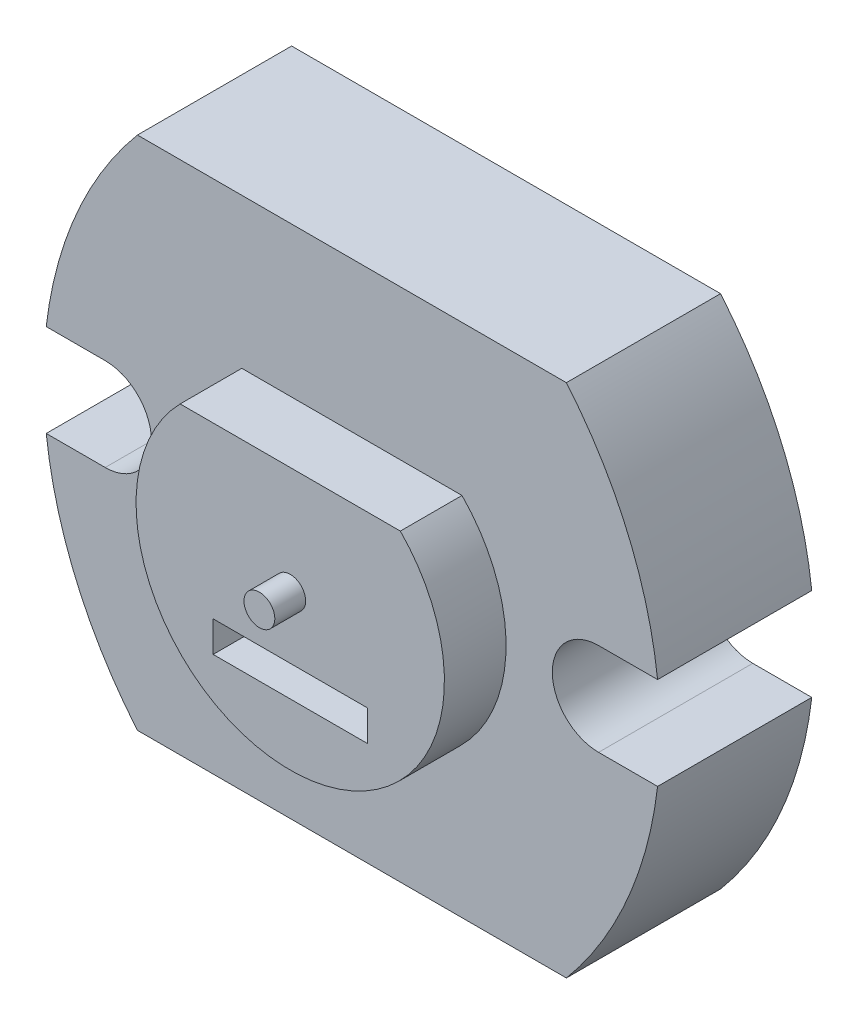
ISO-10303-21;
HEADER;
FILE_DESCRIPTION(('STEP AP214'),'2;1');
FILE_NAME('part.step','',(''),(''),'','','');
FILE_SCHEMA(('AUTOMOTIVE_DESIGN { 1 0 10303 214 1 1 1 1 }'));
ENDSEC;
DATA;
#1=APPLICATION_CONTEXT('core data for automotive mechanical design processes');
#2=APPLICATION_PROTOCOL_DEFINITION('international standard','automotive_design',2000,#1);
#3=PRODUCT_CONTEXT('',#1,'mechanical');
#4=PRODUCT('Part','Part','',(#3));
#5=PRODUCT_RELATED_PRODUCT_CATEGORY('part','',(#4));
#6=PRODUCT_DEFINITION_FORMATION('','',#4);
#7=PRODUCT_DEFINITION_CONTEXT('part definition',#1,'design');
#8=PRODUCT_DEFINITION('design','',#6,#7);
#9=PRODUCT_DEFINITION_SHAPE('','',#8);
#10=(LENGTH_UNIT() NAMED_UNIT(*) SI_UNIT(.MILLI.,.METRE.));
#11=(NAMED_UNIT(*) PLANE_ANGLE_UNIT() SI_UNIT($,.RADIAN.));
#12=(NAMED_UNIT(*) SI_UNIT($,.STERADIAN.) SOLID_ANGLE_UNIT());
#13=UNCERTAINTY_MEASURE_WITH_UNIT(LENGTH_MEASURE(1.E-05),#10,'distance_accuracy_value','');
#14=(GEOMETRIC_REPRESENTATION_CONTEXT(3) GLOBAL_UNCERTAINTY_ASSIGNED_CONTEXT((#13)) GLOBAL_UNIT_ASSIGNED_CONTEXT((#10,
#11,#12)) REPRESENTATION_CONTEXT('',''));
#15=CARTESIAN_POINT('',(0.,0.,0.));
#16=DIRECTION('',(0.,0.,1.));
#17=DIRECTION('',(1.,0.,0.));
#18=AXIS2_PLACEMENT_3D('',#15,#16,#17);
#19=CARTESIAN_POINT('',(0.,0.,5.));
#20=DIRECTION('',(0.,0.,1.));
#21=DIRECTION('',(1.,0.,0.));
#22=AXIS2_PLACEMENT_3D('',#19,#20,#21);
#23=PLANE('',#22);
#24=DIRECTION('',(1.,0.,0.));
#25=VECTOR('',#24,1.);
#26=CARTESIAN_POINT('',(-8.,-1.5,5.));
#27=LINE('',#26,#25);
#28=CARTESIAN_POINT('',(-9.91317157014496,-1.5,5.));
#29=VERTEX_POINT('',#28);
#30=CARTESIAN_POINT('',(-8.,-1.5,5.));
#31=VERTEX_POINT('',#30);
#32=EDGE_CURVE('E220',#29,#31,#27,.T.);
#33=ORIENTED_EDGE('',*,*,#32,.F.);
#34=CARTESIAN_POINT('',(3.,0.,5.));
#35=DIRECTION('',(0.,0.,1.));
#36=DIRECTION('',(1.,0.,0.));
#37=AXIS2_PLACEMENT_3D('',#34,#35,#36);
#38=CIRCLE('',#37,13.);
#39=CARTESIAN_POINT('',(-6.95542063400638,-8.36,5.));
#40=VERTEX_POINT('',#39);
#41=EDGE_CURVE('E262',#40,#29,#38,.F.);
#42=ORIENTED_EDGE('',*,*,#41,.F.);
#43=DIRECTION('',(1.,0.,0.));
#44=VECTOR('',#43,1.);
#45=CARTESIAN_POINT('',(0.,-8.36,5.));
#46=LINE('',#45,#44);
#47=CARTESIAN_POINT('',(6.95542063400638,-8.36,5.));
#48=VERTEX_POINT('',#47);
#49=EDGE_CURVE('E265',#40,#48,#46,.T.);
#50=ORIENTED_EDGE('',*,*,#49,.T.);
#51=CARTESIAN_POINT('',(-3.,0.,5.));
#52=DIRECTION('',(0.,0.,1.));
#53=DIRECTION('',(1.,0.,0.));
#54=AXIS2_PLACEMENT_3D('',#51,#52,#53);
#55=CIRCLE('',#54,13.);
#56=CARTESIAN_POINT('',(9.91317157014496,-1.5,5.));
#57=VERTEX_POINT('',#56);
#58=EDGE_CURVE('E269',#48,#57,#55,.T.);
#59=ORIENTED_EDGE('',*,*,#58,.T.);
#60=DIRECTION('',(1.,0.,0.));
#61=VECTOR('',#60,1.);
#62=CARTESIAN_POINT('',(9.91317157014496,-1.5,5.));
#63=LINE('',#62,#61);
#64=CARTESIAN_POINT('',(8.,-1.5,5.));
#65=VERTEX_POINT('',#64);
#66=EDGE_CURVE('E248',#65,#57,#63,.T.);
#67=ORIENTED_EDGE('',*,*,#66,.F.);
#68=CARTESIAN_POINT('',(8.,0.,5.));
#69=DIRECTION('',(0.,0.,1.));
#70=DIRECTION('',(-1.,0.,0.));
#71=AXIS2_PLACEMENT_3D('',#68,#69,#70);
#72=CIRCLE('',#71,1.5);
#73=CARTESIAN_POINT('',(8.,1.5,5.));
#74=VERTEX_POINT('',#73);
#75=EDGE_CURVE('E237',#74,#65,#72,.T.);
#76=ORIENTED_EDGE('',*,*,#75,.F.);
#77=DIRECTION('',(-1.,0.,0.));
#78=VECTOR('',#77,1.);
#79=CARTESIAN_POINT('',(8.,1.5,5.));
#80=LINE('',#79,#78);
#81=CARTESIAN_POINT('',(9.91317157014496,1.5,5.));
#82=VERTEX_POINT('',#81);
#83=EDGE_CURVE('E242',#82,#74,#80,.T.);
#84=ORIENTED_EDGE('',*,*,#83,.F.);
#85=CARTESIAN_POINT('',(6.95542063400638,8.36,5.));
#86=VERTEX_POINT('',#85);
#87=EDGE_CURVE('E268',#82,#86,#55,.T.);
#88=ORIENTED_EDGE('',*,*,#87,.T.);
#89=DIRECTION('',(1.,0.,0.));
#90=VECTOR('',#89,1.);
#91=CARTESIAN_POINT('',(0.,8.36,5.));
#92=LINE('',#91,#90);
#93=CARTESIAN_POINT('',(-6.95542063400638,8.36,5.));
#94=VERTEX_POINT('',#93);
#95=EDGE_CURVE('E272',#94,#86,#92,.T.);
#96=ORIENTED_EDGE('',*,*,#95,.F.);
#97=CARTESIAN_POINT('',(-9.91317157014496,1.5,5.));
#98=VERTEX_POINT('',#97);
#99=EDGE_CURVE('E266',#98,#94,#38,.F.);
#100=ORIENTED_EDGE('',*,*,#99,.F.);
#101=DIRECTION('',(-1.,0.,0.));
#102=VECTOR('',#101,1.);
#103=CARTESIAN_POINT('',(-9.91317157014496,1.5,5.));
#104=LINE('',#103,#102);
#105=CARTESIAN_POINT('',(-8.,1.5,5.));
#106=VERTEX_POINT('',#105);
#107=EDGE_CURVE('E226',#106,#98,#104,.T.);
#108=ORIENTED_EDGE('',*,*,#107,.F.);
#109=CARTESIAN_POINT('',(-8.,0.,5.));
#110=DIRECTION('',(0.,0.,1.));
#111=DIRECTION('',(1.,0.,0.));
#112=AXIS2_PLACEMENT_3D('',#109,#110,#111);
#113=CIRCLE('',#112,1.5);
#114=EDGE_CURVE('E215',#31,#106,#113,.T.);
#115=ORIENTED_EDGE('',*,*,#114,.F.);
#116=EDGE_LOOP('',(#33,#42,#50,#59,#67,#76,#84,#88,#96,#100,#108,#115));
#117=FACE_BOUND('',#116,.T.);
#118=DIRECTION('',(-1.,0.,0.));
#119=VECTOR('',#118,1.);
#120=CARTESIAN_POINT('',(-3.57071421427143,3.5,5.));
#121=LINE('',#120,#119);
#122=CARTESIAN_POINT('',(3.57071421427143,3.5,5.));
#123=VERTEX_POINT('',#122);
#124=CARTESIAN_POINT('',(-3.57071421427143,3.5,5.));
#125=VERTEX_POINT('',#124);
#126=EDGE_CURVE('E204',#123,#125,#121,.T.);
#127=ORIENTED_EDGE('',*,*,#126,.F.);
#128=CARTESIAN_POINT('',(0.,0.,5.));
#129=DIRECTION('',(0.,0.,1.));
#130=DIRECTION('',(1.,0.,0.));
#131=AXIS2_PLACEMENT_3D('',#128,#129,#130);
#132=CIRCLE('',#131,5.);
#133=EDGE_CURVE('E58',#125,#123,#132,.T.);
#134=ORIENTED_EDGE('',*,*,#133,.F.);
#135=EDGE_LOOP('',(#127,#134));
#136=FACE_BOUND('',#135,.T.);
#137=ADVANCED_FACE('F34',(#117,#136),#23,.T.);
#138=CARTESIAN_POINT('',(3.,0.,5.));
#139=DIRECTION('',(0.,0.,-1.));
#140=DIRECTION('',(-1.,0.,0.));
#141=AXIS2_PLACEMENT_3D('',#138,#139,#140);
#142=CYLINDRICAL_SURFACE('',#141,13.);
#143=DIRECTION('',(0.,0.,-1.));
#144=VECTOR('',#143,1.);
#145=CARTESIAN_POINT('',(-9.91317157014496,-1.5,5.));
#146=LINE('',#145,#144);
#147=CARTESIAN_POINT('',(-9.91317157014496,-1.5,0.));
#148=VERTEX_POINT('',#147);
#149=EDGE_CURVE('E235',#148,#29,#146,.F.);
#150=ORIENTED_EDGE('',*,*,#149,.F.);
#151=CARTESIAN_POINT('',(3.,0.,0.));
#152=DIRECTION('',(0.,0.,1.));
#153=DIRECTION('',(1.,0.,0.));
#154=AXIS2_PLACEMENT_3D('',#151,#152,#153);
#155=CIRCLE('',#154,13.);
#156=CARTESIAN_POINT('',(-6.95542063400638,-8.36,0.));
#157=VERTEX_POINT('',#156);
#158=EDGE_CURVE('E276',#157,#148,#155,.F.);
#159=ORIENTED_EDGE('',*,*,#158,.F.);
#160=DIRECTION('',(0.,0.,-1.));
#161=VECTOR('',#160,1.);
#162=CARTESIAN_POINT('',(-6.95542063400638,-8.36,5.));
#163=LINE('',#162,#161);
#164=EDGE_CURVE('E296',#40,#157,#163,.T.);
#165=ORIENTED_EDGE('',*,*,#164,.F.);
#166=ORIENTED_EDGE('',*,*,#41,.T.);
#167=EDGE_LOOP('',(#150,#159,#165,#166));
#168=FACE_BOUND('',#167,.T.);
#169=ADVANCED_FACE('F335',(#168),#142,.T.);
#170=CARTESIAN_POINT('',(-3.,0.,5.));
#171=DIRECTION('',(0.,0.,-1.));
#172=DIRECTION('',(-1.,0.,0.));
#173=AXIS2_PLACEMENT_3D('',#170,#171,#172);
#174=CYLINDRICAL_SURFACE('',#173,13.);
#175=ORIENTED_EDGE('',*,*,#87,.F.);
#176=DIRECTION('',(0.,0.,-1.));
#177=VECTOR('',#176,1.);
#178=CARTESIAN_POINT('',(9.91317157014496,1.5,5.));
#179=LINE('',#178,#177);
#180=CARTESIAN_POINT('',(9.91317157014496,1.5,0.));
#181=VERTEX_POINT('',#180);
#182=EDGE_CURVE('E258',#82,#181,#179,.T.);
#183=ORIENTED_EDGE('',*,*,#182,.T.);
#184=CARTESIAN_POINT('',(-3.,0.,0.));
#185=DIRECTION('',(0.,0.,1.));
#186=DIRECTION('',(1.,0.,0.));
#187=AXIS2_PLACEMENT_3D('',#184,#185,#186);
#188=CIRCLE('',#187,13.);
#189=CARTESIAN_POINT('',(6.95542063400638,8.36,0.));
#190=VERTEX_POINT('',#189);
#191=EDGE_CURVE('E281',#181,#190,#188,.T.);
#192=ORIENTED_EDGE('',*,*,#191,.T.);
#193=DIRECTION('',(0.,0.,-1.));
#194=VECTOR('',#193,1.);
#195=CARTESIAN_POINT('',(6.95542063400638,8.36,5.));
#196=LINE('',#195,#194);
#197=EDGE_CURVE('E290',#86,#190,#196,.T.);
#198=ORIENTED_EDGE('',*,*,#197,.F.);
#199=EDGE_LOOP('',(#175,#183,#192,#198));
#200=FACE_BOUND('',#199,.T.);
#201=ADVANCED_FACE('F308',(#200),#174,.T.);
#202=DIRECTION('',(0.,0.,-1.));
#203=VECTOR('',#202,1.);
#204=CARTESIAN_POINT('',(-9.91317157014496,1.5,5.));
#205=LINE('',#204,#203);
#206=CARTESIAN_POINT('',(-9.91317157014496,1.5,0.));
#207=VERTEX_POINT('',#206);
#208=EDGE_CURVE('E232',#98,#207,#205,.T.);
#209=ORIENTED_EDGE('',*,*,#208,.F.);
#210=ORIENTED_EDGE('',*,*,#99,.T.);
#211=DIRECTION('',(0.,0.,-1.));
#212=VECTOR('',#211,1.);
#213=CARTESIAN_POINT('',(-6.95542063400638,8.36,5.));
#214=LINE('',#213,#212);
#215=CARTESIAN_POINT('',(-6.95542063400638,8.36,0.));
#216=VERTEX_POINT('',#215);
#217=EDGE_CURVE('E275',#94,#216,#214,.T.);
#218=ORIENTED_EDGE('',*,*,#217,.T.);
#219=EDGE_CURVE('E261',#207,#216,#155,.F.);
#220=ORIENTED_EDGE('',*,*,#219,.F.);
#221=EDGE_LOOP('',(#209,#210,#218,#220));
#222=FACE_BOUND('',#221,.T.);
#223=ADVANCED_FACE('F36',(#222),#142,.T.);
#224=CARTESIAN_POINT('',(0.,-8.36,5.));
#225=DIRECTION('',(0.,1.,0.));
#226=DIRECTION('',(-1.,0.,0.));
#227=AXIS2_PLACEMENT_3D('',#224,#225,#226);
#228=PLANE('',#227);
#229=DIRECTION('',(1.,0.,0.));
#230=VECTOR('',#229,1.);
#231=CARTESIAN_POINT('',(0.,-8.36,0.));
#232=LINE('',#231,#230);
#233=CARTESIAN_POINT('',(6.95542063400638,-8.36,0.));
#234=VERTEX_POINT('',#233);
#235=EDGE_CURVE('E279',#157,#234,#232,.T.);
#236=ORIENTED_EDGE('',*,*,#235,.T.);
#237=DIRECTION('',(0.,0.,-1.));
#238=VECTOR('',#237,1.);
#239=CARTESIAN_POINT('',(6.95542063400638,-8.36,5.));
#240=LINE('',#239,#238);
#241=EDGE_CURVE('E293',#48,#234,#240,.T.);
#242=ORIENTED_EDGE('',*,*,#241,.F.);
#243=ORIENTED_EDGE('',*,*,#49,.F.);
#244=ORIENTED_EDGE('',*,*,#164,.T.);
#245=EDGE_LOOP('',(#236,#242,#243,#244));
#246=FACE_BOUND('',#245,.T.);
#247=ADVANCED_FACE('F330',(#246),#228,.F.);
#248=CARTESIAN_POINT('',(9.91317157014496,-1.5,0.));
#249=VERTEX_POINT('',#248);
#250=EDGE_CURVE('E282',#234,#249,#188,.T.);
#251=ORIENTED_EDGE('',*,*,#250,.T.);
#252=DIRECTION('',(0.,0.,-1.));
#253=VECTOR('',#252,1.);
#254=CARTESIAN_POINT('',(9.91317157014496,-1.5,5.));
#255=LINE('',#254,#253);
#256=EDGE_CURVE('E254',#249,#57,#255,.F.);
#257=ORIENTED_EDGE('',*,*,#256,.T.);
#258=ORIENTED_EDGE('',*,*,#58,.F.);
#259=ORIENTED_EDGE('',*,*,#241,.T.);
#260=EDGE_LOOP('',(#251,#257,#258,#259));
#261=FACE_BOUND('',#260,.T.);
#262=ADVANCED_FACE('F325',(#261),#174,.T.);
#263=CARTESIAN_POINT('',(0.,8.36,5.));
#264=DIRECTION('',(0.,1.,0.));
#265=DIRECTION('',(-1.,0.,0.));
#266=AXIS2_PLACEMENT_3D('',#263,#264,#265);
#267=PLANE('',#266);
#268=DIRECTION('',(1.,0.,0.));
#269=VECTOR('',#268,1.);
#270=CARTESIAN_POINT('',(0.,8.36,0.));
#271=LINE('',#270,#269);
#272=EDGE_CURVE('E285',#216,#190,#271,.T.);
#273=ORIENTED_EDGE('',*,*,#272,.F.);
#274=ORIENTED_EDGE('',*,*,#217,.F.);
#275=ORIENTED_EDGE('',*,*,#95,.T.);
#276=ORIENTED_EDGE('',*,*,#197,.T.);
#277=EDGE_LOOP('',(#273,#274,#275,#276));
#278=FACE_BOUND('',#277,.T.);
#279=ADVANCED_FACE('F351',(#278),#267,.T.);
#280=CARTESIAN_POINT('',(0.,0.,0.));
#281=DIRECTION('',(0.,0.,1.));
#282=DIRECTION('',(1.,0.,0.));
#283=AXIS2_PLACEMENT_3D('',#280,#281,#282);
#284=PLANE('',#283);
#285=ORIENTED_EDGE('',*,*,#158,.T.);
#286=DIRECTION('',(1.,0.,0.));
#287=VECTOR('',#286,1.);
#288=CARTESIAN_POINT('',(0.,-1.5,0.));
#289=LINE('',#288,#287);
#290=CARTESIAN_POINT('',(-8.,-1.5,0.));
#291=VERTEX_POINT('',#290);
#292=EDGE_CURVE('E11',#148,#291,#289,.T.);
#293=ORIENTED_EDGE('',*,*,#292,.T.);
#294=CARTESIAN_POINT('',(-8.,0.,0.));
#295=DIRECTION('',(0.,0.,1.));
#296=DIRECTION('',(1.,0.,0.));
#297=AXIS2_PLACEMENT_3D('',#294,#295,#296);
#298=CIRCLE('',#297,1.5);
#299=CARTESIAN_POINT('',(-8.,1.5,0.));
#300=VERTEX_POINT('',#299);
#301=EDGE_CURVE('E216',#291,#300,#298,.T.);
#302=ORIENTED_EDGE('',*,*,#301,.T.);
#303=DIRECTION('',(-1.,0.,0.));
#304=VECTOR('',#303,1.);
#305=CARTESIAN_POINT('',(-8.,1.5,0.));
#306=LINE('',#305,#304);
#307=EDGE_CURVE('E219',#300,#207,#306,.T.);
#308=ORIENTED_EDGE('',*,*,#307,.T.);
#309=ORIENTED_EDGE('',*,*,#219,.T.);
#310=ORIENTED_EDGE('',*,*,#272,.T.);
#311=ORIENTED_EDGE('',*,*,#191,.F.);
#312=DIRECTION('',(-1.,0.,0.));
#313=VECTOR('',#312,1.);
#314=CARTESIAN_POINT('',(0.,1.5,0.));
#315=LINE('',#314,#313);
#316=CARTESIAN_POINT('',(8.,1.5,0.));
#317=VERTEX_POINT('',#316);
#318=EDGE_CURVE('E43',#181,#317,#315,.T.);
#319=ORIENTED_EDGE('',*,*,#318,.T.);
#320=CARTESIAN_POINT('',(8.,0.,0.));
#321=DIRECTION('',(0.,0.,1.));
#322=DIRECTION('',(-1.,0.,0.));
#323=AXIS2_PLACEMENT_3D('',#320,#321,#322);
#324=CIRCLE('',#323,1.5);
#325=CARTESIAN_POINT('',(8.,-1.5,0.));
#326=VERTEX_POINT('',#325);
#327=EDGE_CURVE('E238',#317,#326,#324,.T.);
#328=ORIENTED_EDGE('',*,*,#327,.T.);
#329=DIRECTION('',(1.,0.,0.));
#330=VECTOR('',#329,1.);
#331=CARTESIAN_POINT('',(8.,-1.5,0.));
#332=LINE('',#331,#330);
#333=EDGE_CURVE('E241',#326,#249,#332,.T.);
#334=ORIENTED_EDGE('',*,*,#333,.T.);
#335=ORIENTED_EDGE('',*,*,#250,.F.);
#336=ORIENTED_EDGE('',*,*,#235,.F.);
#337=EDGE_LOOP('',(#285,#293,#302,#308,#309,#310,#311,#319,#328,#334,#335,#336));
#338=FACE_BOUND('',#337,.T.);
#339=ADVANCED_FACE('F301',(#338),#284,.F.);
#340=CARTESIAN_POINT('',(8.,1.5,0.));
#341=DIRECTION('',(0.,1.,0.));
#342=DIRECTION('',(0.,0.,1.));
#343=AXIS2_PLACEMENT_3D('',#340,#341,#342);
#344=PLANE('',#343);
#345=ORIENTED_EDGE('',*,*,#83,.T.);
#346=DIRECTION('',(0.,0.,1.));
#347=VECTOR('',#346,1.);
#348=CARTESIAN_POINT('',(8.,1.5,0.));
#349=LINE('',#348,#347);
#350=EDGE_CURVE('E251',#317,#74,#349,.T.);
#351=ORIENTED_EDGE('',*,*,#350,.F.);
#352=ORIENTED_EDGE('',*,*,#318,.F.);
#353=ORIENTED_EDGE('',*,*,#182,.F.);
#354=EDGE_LOOP('',(#345,#351,#352,#353));
#355=FACE_BOUND('',#354,.T.);
#356=ADVANCED_FACE('F304',(#355),#344,.F.);
#357=CARTESIAN_POINT('',(9.91317157014496,-1.5,0.));
#358=DIRECTION('',(0.,-1.,0.));
#359=DIRECTION('',(0.,0.,-1.));
#360=AXIS2_PLACEMENT_3D('',#357,#358,#359);
#361=PLANE('',#360);
#362=ORIENTED_EDGE('',*,*,#333,.F.);
#363=DIRECTION('',(0.,0.,1.));
#364=VECTOR('',#363,1.);
#365=CARTESIAN_POINT('',(8.,-1.5,0.));
#366=LINE('',#365,#364);
#367=EDGE_CURVE('E245',#326,#65,#366,.T.);
#368=ORIENTED_EDGE('',*,*,#367,.T.);
#369=ORIENTED_EDGE('',*,*,#66,.T.);
#370=ORIENTED_EDGE('',*,*,#256,.F.);
#371=EDGE_LOOP('',(#362,#368,#369,#370));
#372=FACE_BOUND('',#371,.T.);
#373=ADVANCED_FACE('F321',(#372),#361,.F.);
#374=CARTESIAN_POINT('',(8.,0.,0.));
#375=DIRECTION('',(0.,0.,1.));
#376=DIRECTION('',(1.,0.,0.));
#377=AXIS2_PLACEMENT_3D('',#374,#375,#376);
#378=CYLINDRICAL_SURFACE('',#377,1.5);
#379=ORIENTED_EDGE('',*,*,#75,.T.);
#380=ORIENTED_EDGE('',*,*,#367,.F.);
#381=ORIENTED_EDGE('',*,*,#327,.F.);
#382=ORIENTED_EDGE('',*,*,#350,.T.);
#383=EDGE_LOOP('',(#379,#380,#381,#382));
#384=FACE_BOUND('',#383,.T.);
#385=ADVANCED_FACE('F318',(#384),#378,.F.);
#386=CARTESIAN_POINT('',(-8.,0.,0.));
#387=DIRECTION('',(0.,0.,1.));
#388=DIRECTION('',(1.,0.,0.));
#389=AXIS2_PLACEMENT_3D('',#386,#387,#388);
#390=CYLINDRICAL_SURFACE('',#389,1.5);
#391=ORIENTED_EDGE('',*,*,#114,.T.);
#392=DIRECTION('',(0.,0.,1.));
#393=VECTOR('',#392,1.);
#394=CARTESIAN_POINT('',(-8.,1.5,0.));
#395=LINE('',#394,#393);
#396=EDGE_CURVE('E223',#300,#106,#395,.T.);
#397=ORIENTED_EDGE('',*,*,#396,.F.);
#398=ORIENTED_EDGE('',*,*,#301,.F.);
#399=DIRECTION('',(0.,0.,1.));
#400=VECTOR('',#399,1.);
#401=CARTESIAN_POINT('',(-8.,-1.5,0.));
#402=LINE('',#401,#400);
#403=EDGE_CURVE('E229',#291,#31,#402,.T.);
#404=ORIENTED_EDGE('',*,*,#403,.T.);
#405=EDGE_LOOP('',(#391,#397,#398,#404));
#406=FACE_BOUND('',#405,.T.);
#407=ADVANCED_FACE('F341',(#406),#390,.F.);
#408=CARTESIAN_POINT('',(-8.,-1.5,0.));
#409=DIRECTION('',(0.,-1.,0.));
#410=DIRECTION('',(0.,0.,-1.));
#411=AXIS2_PLACEMENT_3D('',#408,#409,#410);
#412=PLANE('',#411);
#413=ORIENTED_EDGE('',*,*,#149,.T.);
#414=ORIENTED_EDGE('',*,*,#32,.T.);
#415=ORIENTED_EDGE('',*,*,#403,.F.);
#416=ORIENTED_EDGE('',*,*,#292,.F.);
#417=EDGE_LOOP('',(#413,#414,#415,#416));
#418=FACE_BOUND('',#417,.T.);
#419=ADVANCED_FACE('F337',(#418),#412,.F.);
#420=CARTESIAN_POINT('',(-9.91317157014496,1.5,0.));
#421=DIRECTION('',(0.,1.,0.));
#422=DIRECTION('',(0.,0.,1.));
#423=AXIS2_PLACEMENT_3D('',#420,#421,#422);
#424=PLANE('',#423);
#425=ORIENTED_EDGE('',*,*,#208,.T.);
#426=ORIENTED_EDGE('',*,*,#307,.F.);
#427=ORIENTED_EDGE('',*,*,#396,.T.);
#428=ORIENTED_EDGE('',*,*,#107,.T.);
#429=EDGE_LOOP('',(#425,#426,#427,#428));
#430=FACE_BOUND('',#429,.T.);
#431=ADVANCED_FACE('F374',(#430),#424,.F.);
#432=CARTESIAN_POINT('',(0.,0.,7.));
#433=DIRECTION('',(0.,0.,1.));
#434=DIRECTION('',(1.,0.,0.));
#435=AXIS2_PLACEMENT_3D('',#432,#433,#434);
#436=PLANE('',#435);
#437=DIRECTION('',(0.,-1.,0.));
#438=VECTOR('',#437,1.);
#439=CARTESIAN_POINT('',(-2.5,-2.,7.));
#440=LINE('',#439,#438);
#441=CARTESIAN_POINT('',(-2.5,-2.,7.));
#442=VERTEX_POINT('',#441);
#443=CARTESIAN_POINT('',(-2.5,-3.,7.));
#444=VERTEX_POINT('',#443);
#445=EDGE_CURVE('E50',#442,#444,#440,.T.);
#446=ORIENTED_EDGE('',*,*,#445,.F.);
#447=DIRECTION('',(-1.,0.,0.));
#448=VECTOR('',#447,1.);
#449=CARTESIAN_POINT('',(-2.5,-2.,7.));
#450=LINE('',#449,#448);
#451=CARTESIAN_POINT('',(2.5,-2.,7.));
#452=VERTEX_POINT('',#451);
#453=EDGE_CURVE('E182',#452,#442,#450,.T.);
#454=ORIENTED_EDGE('',*,*,#453,.F.);
#455=DIRECTION('',(0.,1.,0.));
#456=VECTOR('',#455,1.);
#457=CARTESIAN_POINT('',(2.5,-2.,7.));
#458=LINE('',#457,#456);
#459=CARTESIAN_POINT('',(2.5,-3.,7.));
#460=VERTEX_POINT('',#459);
#461=EDGE_CURVE('E185',#460,#452,#458,.T.);
#462=ORIENTED_EDGE('',*,*,#461,.F.);
#463=DIRECTION('',(1.,0.,0.));
#464=VECTOR('',#463,1.);
#465=CARTESIAN_POINT('',(-2.5,-3.,7.));
#466=LINE('',#465,#464);
#467=EDGE_CURVE('E191',#444,#460,#466,.T.);
#468=ORIENTED_EDGE('',*,*,#467,.F.);
#469=EDGE_LOOP('',(#446,#454,#462,#468));
#470=FACE_BOUND('',#469,.T.);
#471=CARTESIAN_POINT('',(0.,0.,7.));
#472=DIRECTION('',(0.,0.,1.));
#473=DIRECTION('',(1.,0.,0.));
#474=AXIS2_PLACEMENT_3D('',#471,#472,#473);
#475=CIRCLE('',#474,5.);
#476=CARTESIAN_POINT('',(-3.57071421427143,3.5,7.));
#477=VERTEX_POINT('',#476);
#478=CARTESIAN_POINT('',(3.57071421427143,3.5,7.));
#479=VERTEX_POINT('',#478);
#480=EDGE_CURVE('E200',#477,#479,#475,.T.);
#481=ORIENTED_EDGE('',*,*,#480,.T.);
#482=DIRECTION('',(-1.,0.,0.));
#483=VECTOR('',#482,1.);
#484=CARTESIAN_POINT('',(-3.57071421427143,3.5,7.));
#485=LINE('',#484,#483);
#486=EDGE_CURVE('E203',#479,#477,#485,.T.);
#487=ORIENTED_EDGE('',*,*,#486,.T.);
#488=EDGE_LOOP('',(#481,#487));
#489=FACE_BOUND('',#488,.T.);
#490=CARTESIAN_POINT('',(0.,0.,7.));
#491=DIRECTION('',(0.,0.,1.));
#492=DIRECTION('',(1.,0.,0.));
#493=AXIS2_PLACEMENT_3D('',#490,#491,#492);
#494=CIRCLE('',#493,0.5);
#495=CARTESIAN_POINT('',(0.5,0.,7.));
#496=VERTEX_POINT('',#495);
#497=EDGE_CURVE('E38',#496,#496,#494,.T.);
#498=ORIENTED_EDGE('',*,*,#497,.F.);
#499=EDGE_LOOP('',(#498));
#500=FACE_BOUND('',#499,.T.);
#501=ADVANCED_FACE('F377',(#470,#489,#500),#436,.T.);
#502=CARTESIAN_POINT('',(0.,0.,7.));
#503=DIRECTION('',(0.,0.,-1.));
#504=DIRECTION('',(-1.,0.,0.));
#505=AXIS2_PLACEMENT_3D('',#502,#503,#504);
#506=CYLINDRICAL_SURFACE('',#505,5.);
#507=ORIENTED_EDGE('',*,*,#133,.T.);
#508=DIRECTION('',(0.,0.,-1.));
#509=VECTOR('',#508,1.);
#510=CARTESIAN_POINT('',(3.57071421427143,3.5,7.));
#511=LINE('',#510,#509);
#512=EDGE_CURVE('E210',#479,#123,#511,.T.);
#513=ORIENTED_EDGE('',*,*,#512,.F.);
#514=ORIENTED_EDGE('',*,*,#480,.F.);
#515=DIRECTION('',(0.,0.,-1.));
#516=VECTOR('',#515,1.);
#517=CARTESIAN_POINT('',(-3.57071421427143,3.5,7.));
#518=LINE('',#517,#516);
#519=EDGE_CURVE('E206',#477,#125,#518,.T.);
#520=ORIENTED_EDGE('',*,*,#519,.T.);
#521=EDGE_LOOP('',(#507,#513,#514,#520));
#522=FACE_BOUND('',#521,.T.);
#523=ADVANCED_FACE('F389',(#522),#506,.T.);
#524=CARTESIAN_POINT('',(-3.57071421427143,3.5,7.));
#525=DIRECTION('',(0.,-1.,0.));
#526=DIRECTION('',(0.,0.,-1.));
#527=AXIS2_PLACEMENT_3D('',#524,#525,#526);
#528=PLANE('',#527);
#529=ORIENTED_EDGE('',*,*,#126,.T.);
#530=ORIENTED_EDGE('',*,*,#519,.F.);
#531=ORIENTED_EDGE('',*,*,#486,.F.);
#532=ORIENTED_EDGE('',*,*,#512,.T.);
#533=EDGE_LOOP('',(#529,#530,#531,#532));
#534=FACE_BOUND('',#533,.T.);
#535=ADVANCED_FACE('F387',(#534),#528,.F.);
#536=CARTESIAN_POINT('',(0.,0.,8.));
#537=DIRECTION('',(0.,0.,1.));
#538=DIRECTION('',(1.,0.,0.));
#539=AXIS2_PLACEMENT_3D('',#536,#537,#538);
#540=PLANE('',#539);
#541=CARTESIAN_POINT('',(0.,0.,8.));
#542=DIRECTION('',(0.,0.,1.));
#543=DIRECTION('',(1.,0.,0.));
#544=AXIS2_PLACEMENT_3D('',#541,#542,#543);
#545=CIRCLE('',#544,0.5);
#546=CARTESIAN_POINT('',(0.5,0.,8.));
#547=VERTEX_POINT('',#546);
#548=EDGE_CURVE('E212',#547,#547,#545,.T.);
#549=ORIENTED_EDGE('',*,*,#548,.T.);
#550=EDGE_LOOP('',(#549));
#551=FACE_BOUND('',#550,.T.);
#552=ADVANCED_FACE('F383',(#551),#540,.T.);
#553=CARTESIAN_POINT('',(0.,0.,8.));
#554=DIRECTION('',(0.,0.,-1.));
#555=DIRECTION('',(-1.,0.,0.));
#556=AXIS2_PLACEMENT_3D('',#553,#554,#555);
#557=CYLINDRICAL_SURFACE('',#556,0.5);
#558=ORIENTED_EDGE('',*,*,#497,.T.);
#559=EDGE_LOOP('',(#558));
#560=FACE_BOUND('',#559,.T.);
#561=ORIENTED_EDGE('',*,*,#548,.F.);
#562=EDGE_LOOP('',(#561));
#563=FACE_BOUND('',#562,.T.);
#564=ADVANCED_FACE('F380',(#560,#563),#557,.T.);
#565=CARTESIAN_POINT('',(-2.5,-2.,5.));
#566=DIRECTION('',(-1.,0.,0.));
#567=DIRECTION('',(0.,-1.,0.));
#568=AXIS2_PLACEMENT_3D('',#565,#566,#567);
#569=PLANE('',#568);
#570=ORIENTED_EDGE('',*,*,#445,.T.);
#571=DIRECTION('',(0.,0.,1.));
#572=VECTOR('',#571,1.);
#573=CARTESIAN_POINT('',(-2.5,-3.,5.));
#574=LINE('',#573,#572);
#575=CARTESIAN_POINT('',(-2.5,-3.,5.));
#576=VERTEX_POINT('',#575);
#577=EDGE_CURVE('E160',#576,#444,#574,.T.);
#578=ORIENTED_EDGE('',*,*,#577,.F.);
#579=DIRECTION('',(0.,-1.,0.));
#580=VECTOR('',#579,1.);
#581=CARTESIAN_POINT('',(-2.5,-2.,5.));
#582=LINE('',#581,#580);
#583=CARTESIAN_POINT('',(-2.5,-2.,5.));
#584=VERTEX_POINT('',#583);
#585=EDGE_CURVE('E164',#584,#576,#582,.T.);
#586=ORIENTED_EDGE('',*,*,#585,.F.);
#587=DIRECTION('',(0.,0.,1.));
#588=VECTOR('',#587,1.);
#589=CARTESIAN_POINT('',(-2.5,-2.,5.));
#590=LINE('',#589,#588);
#591=EDGE_CURVE('E195',#584,#442,#590,.T.);
#592=ORIENTED_EDGE('',*,*,#591,.T.);
#593=EDGE_LOOP('',(#570,#578,#586,#592));
#594=FACE_BOUND('',#593,.T.);
#595=ADVANCED_FACE('F162',(#594),#569,.F.);
#596=CARTESIAN_POINT('',(-2.5,-2.,5.));
#597=DIRECTION('',(0.,1.,0.));
#598=DIRECTION('',(-1.,0.,0.));
#599=AXIS2_PLACEMENT_3D('',#596,#597,#598);
#600=PLANE('',#599);
#601=ORIENTED_EDGE('',*,*,#453,.T.);
#602=ORIENTED_EDGE('',*,*,#591,.F.);
#603=DIRECTION('',(-1.,0.,0.));
#604=VECTOR('',#603,1.);
#605=CARTESIAN_POINT('',(-2.5,-2.,5.));
#606=LINE('',#605,#604);
#607=CARTESIAN_POINT('',(2.5,-2.,5.));
#608=VERTEX_POINT('',#607);
#609=EDGE_CURVE('E170',#608,#584,#606,.T.);
#610=ORIENTED_EDGE('',*,*,#609,.F.);
#611=DIRECTION('',(0.,0.,1.));
#612=VECTOR('',#611,1.);
#613=CARTESIAN_POINT('',(2.5,-2.,5.));
#614=LINE('',#613,#612);
#615=EDGE_CURVE('E197',#608,#452,#614,.T.);
#616=ORIENTED_EDGE('',*,*,#615,.T.);
#617=EDGE_LOOP('',(#601,#602,#610,#616));
#618=FACE_BOUND('',#617,.T.);
#619=ADVANCED_FACE('F400',(#618),#600,.F.);
#620=CARTESIAN_POINT('',(2.5,-2.,5.));
#621=DIRECTION('',(1.,0.,0.));
#622=DIRECTION('',(0.,1.,0.));
#623=AXIS2_PLACEMENT_3D('',#620,#621,#622);
#624=PLANE('',#623);
#625=ORIENTED_EDGE('',*,*,#461,.T.);
#626=ORIENTED_EDGE('',*,*,#615,.F.);
#627=DIRECTION('',(0.,1.,0.));
#628=VECTOR('',#627,1.);
#629=CARTESIAN_POINT('',(2.5,-2.,5.));
#630=LINE('',#629,#628);
#631=CARTESIAN_POINT('',(2.5,-3.,5.));
#632=VERTEX_POINT('',#631);
#633=EDGE_CURVE('E178',#632,#608,#630,.T.);
#634=ORIENTED_EDGE('',*,*,#633,.F.);
#635=DIRECTION('',(0.,0.,1.));
#636=VECTOR('',#635,1.);
#637=CARTESIAN_POINT('',(2.5,-3.,5.));
#638=LINE('',#637,#636);
#639=EDGE_CURVE('E169',#632,#460,#638,.T.);
#640=ORIENTED_EDGE('',*,*,#639,.T.);
#641=EDGE_LOOP('',(#625,#626,#634,#640));
#642=FACE_BOUND('',#641,.T.);
#643=ADVANCED_FACE('F403',(#642),#624,.F.);
#644=CARTESIAN_POINT('',(-2.5,-3.,5.));
#645=DIRECTION('',(0.,-1.,0.));
#646=DIRECTION('',(1.,0.,0.));
#647=AXIS2_PLACEMENT_3D('',#644,#645,#646);
#648=PLANE('',#647);
#649=ORIENTED_EDGE('',*,*,#467,.T.);
#650=ORIENTED_EDGE('',*,*,#639,.F.);
#651=DIRECTION('',(1.,0.,0.));
#652=VECTOR('',#651,1.);
#653=CARTESIAN_POINT('',(-2.5,-3.,5.));
#654=LINE('',#653,#652);
#655=EDGE_CURVE('E173',#576,#632,#654,.T.);
#656=ORIENTED_EDGE('',*,*,#655,.F.);
#657=ORIENTED_EDGE('',*,*,#577,.T.);
#658=EDGE_LOOP('',(#649,#650,#656,#657));
#659=FACE_BOUND('',#658,.T.);
#660=ADVANCED_FACE('F174',(#659),#648,.F.);
#661=CARTESIAN_POINT('',(0.,0.,5.));
#662=DIRECTION('',(0.,0.,1.));
#663=DIRECTION('',(1.,0.,0.));
#664=AXIS2_PLACEMENT_3D('',#661,#662,#663);
#665=PLANE('',#664);
#666=ORIENTED_EDGE('',*,*,#585,.T.);
#667=ORIENTED_EDGE('',*,*,#655,.T.);
#668=ORIENTED_EDGE('',*,*,#633,.T.);
#669=ORIENTED_EDGE('',*,*,#609,.T.);
#670=EDGE_LOOP('',(#666,#667,#668,#669));
#671=FACE_BOUND('',#670,.T.);
#672=ADVANCED_FACE('F180',(#671),#665,.T.);
#673=CLOSED_SHELL('',(#137,#169,#201,#223,#247,#262,#279,#339,#356,#373,#385,#407,#419,#431,
#501,#523,#535,#552,#564,#595,#619,#643,#660,#672));
#674=MANIFOLD_SOLID_BREP('B2',#673);
#675=ADVANCED_BREP_SHAPE_REPRESENTATION('',(#18,#674),#14);
#676=SHAPE_DEFINITION_REPRESENTATION(#9,#675);
ENDSEC;
END-ISO-10303-21;
